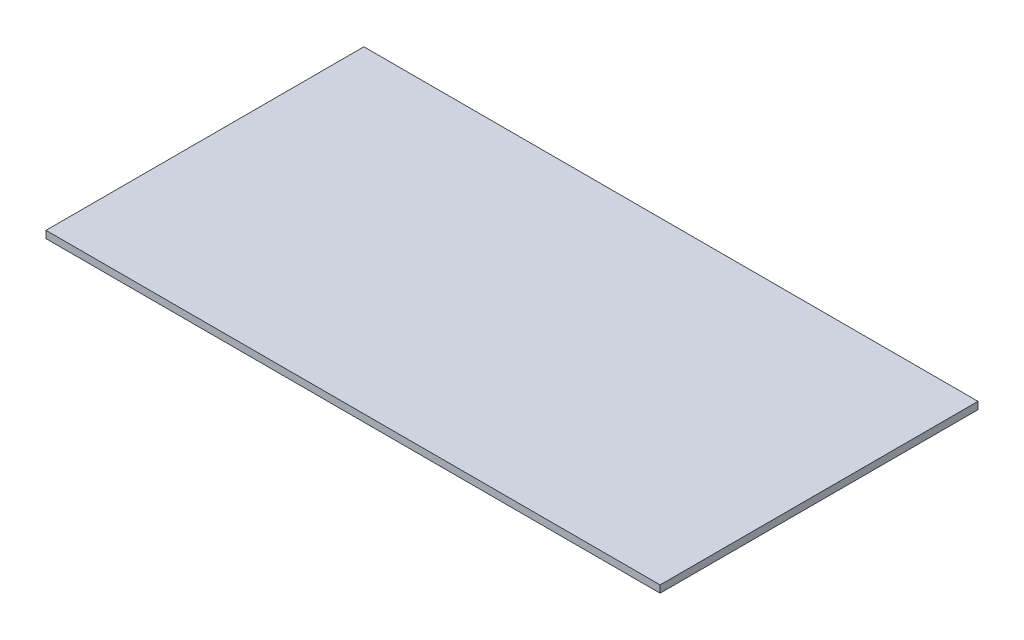
ISO-10303-21;
HEADER;
FILE_DESCRIPTION(('STEP AP214'),'2;1');
FILE_NAME('part.step','',(''),(''),'','','');
FILE_SCHEMA(('AUTOMOTIVE_DESIGN { 1 0 10303 214 1 1 1 1 }'));
ENDSEC;
DATA;
#1=APPLICATION_CONTEXT('core data for automotive mechanical design processes');
#2=APPLICATION_PROTOCOL_DEFINITION('international standard','automotive_design',2000,#1);
#3=PRODUCT_CONTEXT('',#1,'mechanical');
#4=PRODUCT('Part','Part','',(#3));
#5=PRODUCT_RELATED_PRODUCT_CATEGORY('part','',(#4));
#6=PRODUCT_DEFINITION_FORMATION('','',#4);
#7=PRODUCT_DEFINITION_CONTEXT('part definition',#1,'design');
#8=PRODUCT_DEFINITION('design','',#6,#7);
#9=PRODUCT_DEFINITION_SHAPE('','',#8);
#10=(LENGTH_UNIT() NAMED_UNIT(*) SI_UNIT(.MILLI.,.METRE.));
#11=(NAMED_UNIT(*) PLANE_ANGLE_UNIT() SI_UNIT($,.RADIAN.));
#12=(NAMED_UNIT(*) SI_UNIT($,.STERADIAN.) SOLID_ANGLE_UNIT());
#13=UNCERTAINTY_MEASURE_WITH_UNIT(LENGTH_MEASURE(1.E-05),#10,'distance_accuracy_value','');
#14=(GEOMETRIC_REPRESENTATION_CONTEXT(3) GLOBAL_UNCERTAINTY_ASSIGNED_CONTEXT((#13)) GLOBAL_UNIT_ASSIGNED_CONTEXT((#10,
#11,#12)) REPRESENTATION_CONTEXT('',''));
#15=CARTESIAN_POINT('',(0.,0.,0.));
#16=DIRECTION('',(0.,0.,1.));
#17=DIRECTION('',(1.,0.,0.));
#18=AXIS2_PLACEMENT_3D('',#15,#16,#17);
#19=CARTESIAN_POINT('',(-43.5537190082645,1.,-5.43388429752066));
#20=DIRECTION('',(1.,0.,0.));
#21=DIRECTION('',(0.,0.,-1.));
#22=AXIS2_PLACEMENT_3D('',#19,#20,#21);
#23=PLANE('',#22);
#24=DIRECTION('',(0.,0.,1.));
#25=VECTOR('',#24,1.);
#26=CARTESIAN_POINT('',(-43.5537190082645,0.,-5.43388429752066));
#27=LINE('',#26,#25);
#28=CARTESIAN_POINT('',(-43.5537190082645,0.,-5.43388429752066));
#29=VERTEX_POINT('',#28);
#30=CARTESIAN_POINT('',(-43.5537190082645,0.,38.5661157024793));
#31=VERTEX_POINT('',#30);
#32=EDGE_CURVE('E111',#29,#31,#27,.T.);
#33=ORIENTED_EDGE('',*,*,#32,.T.);
#34=DIRECTION('',(0.,-1.,0.));
#35=VECTOR('',#34,1.);
#36=CARTESIAN_POINT('',(-43.5537190082645,1.,38.5661157024793));
#37=LINE('',#36,#35);
#38=CARTESIAN_POINT('',(-43.5537190082645,1.,38.5661157024793));
#39=VERTEX_POINT('',#38);
#40=EDGE_CURVE('E11',#39,#31,#37,.T.);
#41=ORIENTED_EDGE('',*,*,#40,.F.);
#42=DIRECTION('',(0.,0.,1.));
#43=VECTOR('',#42,1.);
#44=CARTESIAN_POINT('',(-43.5537190082645,1.,-5.43388429752066));
#45=LINE('',#44,#43);
#46=CARTESIAN_POINT('',(-43.5537190082645,1.,-5.43388429752066));
#47=VERTEX_POINT('',#46);
#48=EDGE_CURVE('E95',#47,#39,#45,.T.);
#49=ORIENTED_EDGE('',*,*,#48,.F.);
#50=DIRECTION('',(0.,-1.,0.));
#51=VECTOR('',#50,1.);
#52=CARTESIAN_POINT('',(-43.5537190082645,1.,-5.43388429752066));
#53=LINE('',#52,#51);
#54=EDGE_CURVE('E107',#47,#29,#53,.T.);
#55=ORIENTED_EDGE('',*,*,#54,.T.);
#56=EDGE_LOOP('',(#33,#41,#49,#55));
#57=FACE_BOUND('',#56,.T.);
#58=ADVANCED_FACE('F43',(#57),#23,.F.);
#59=CARTESIAN_POINT('',(-43.5537190082645,1.,38.5661157024793));
#60=DIRECTION('',(0.,0.,-1.));
#61=DIRECTION('',(-1.,0.,0.));
#62=AXIS2_PLACEMENT_3D('',#59,#60,#61);
#63=PLANE('',#62);
#64=DIRECTION('',(1.,0.,0.));
#65=VECTOR('',#64,1.);
#66=CARTESIAN_POINT('',(-43.5537190082645,0.,38.5661157024793));
#67=LINE('',#66,#65);
#68=CARTESIAN_POINT('',(41.4462809917355,0.,38.5661157024793));
#69=VERTEX_POINT('',#68);
#70=EDGE_CURVE('E100',#31,#69,#67,.T.);
#71=ORIENTED_EDGE('',*,*,#70,.T.);
#72=DIRECTION('',(0.,-1.,0.));
#73=VECTOR('',#72,1.);
#74=CARTESIAN_POINT('',(41.4462809917355,1.,38.5661157024793));
#75=LINE('',#74,#73);
#76=CARTESIAN_POINT('',(41.4462809917355,1.,38.5661157024793));
#77=VERTEX_POINT('',#76);
#78=EDGE_CURVE('E52',#77,#69,#75,.T.);
#79=ORIENTED_EDGE('',*,*,#78,.F.);
#80=DIRECTION('',(1.,0.,0.));
#81=VECTOR('',#80,1.);
#82=CARTESIAN_POINT('',(-43.5537190082645,1.,38.5661157024793));
#83=LINE('',#82,#81);
#84=EDGE_CURVE('E90',#39,#77,#83,.T.);
#85=ORIENTED_EDGE('',*,*,#84,.F.);
#86=ORIENTED_EDGE('',*,*,#40,.T.);
#87=EDGE_LOOP('',(#71,#79,#85,#86));
#88=FACE_BOUND('',#87,.T.);
#89=ADVANCED_FACE('F99',(#88),#63,.F.);
#90=CARTESIAN_POINT('',(41.4462809917355,1.,-5.43388429752066));
#91=DIRECTION('',(-1.,0.,0.));
#92=DIRECTION('',(0.,0.,1.));
#93=AXIS2_PLACEMENT_3D('',#90,#91,#92);
#94=PLANE('',#93);
#95=DIRECTION('',(0.,0.,-1.));
#96=VECTOR('',#95,1.);
#97=CARTESIAN_POINT('',(41.4462809917355,0.,-5.43388429752066));
#98=LINE('',#97,#96);
#99=CARTESIAN_POINT('',(41.4462809917355,0.,-5.43388429752066));
#100=VERTEX_POINT('',#99);
#101=EDGE_CURVE('E77',#69,#100,#98,.T.);
#102=ORIENTED_EDGE('',*,*,#101,.T.);
#103=DIRECTION('',(0.,-1.,0.));
#104=VECTOR('',#103,1.);
#105=CARTESIAN_POINT('',(41.4462809917355,1.,-5.43388429752066));
#106=LINE('',#105,#104);
#107=CARTESIAN_POINT('',(41.4462809917355,1.,-5.43388429752066));
#108=VERTEX_POINT('',#107);
#109=EDGE_CURVE('E102',#108,#100,#106,.T.);
#110=ORIENTED_EDGE('',*,*,#109,.F.);
#111=DIRECTION('',(0.,0.,-1.));
#112=VECTOR('',#111,1.);
#113=CARTESIAN_POINT('',(41.4462809917355,1.,-5.43388429752066));
#114=LINE('',#113,#112);
#115=EDGE_CURVE('E93',#77,#108,#114,.T.);
#116=ORIENTED_EDGE('',*,*,#115,.F.);
#117=ORIENTED_EDGE('',*,*,#78,.T.);
#118=EDGE_LOOP('',(#102,#110,#116,#117));
#119=FACE_BOUND('',#118,.T.);
#120=ADVANCED_FACE('F103',(#119),#94,.F.);
#121=CARTESIAN_POINT('',(-43.5537190082645,1.,-5.43388429752066));
#122=DIRECTION('',(0.,0.,1.));
#123=DIRECTION('',(1.,0.,0.));
#124=AXIS2_PLACEMENT_3D('',#121,#122,#123);
#125=PLANE('',#124);
#126=DIRECTION('',(-1.,0.,0.));
#127=VECTOR('',#126,1.);
#128=CARTESIAN_POINT('',(-43.5537190082645,0.,-5.43388429752066));
#129=LINE('',#128,#127);
#130=EDGE_CURVE('E83',#100,#29,#129,.T.);
#131=ORIENTED_EDGE('',*,*,#130,.T.);
#132=ORIENTED_EDGE('',*,*,#54,.F.);
#133=DIRECTION('',(-1.,0.,0.));
#134=VECTOR('',#133,1.);
#135=CARTESIAN_POINT('',(-43.5537190082645,1.,-5.43388429752066));
#136=LINE('',#135,#134);
#137=EDGE_CURVE('E60',#108,#47,#136,.T.);
#138=ORIENTED_EDGE('',*,*,#137,.F.);
#139=ORIENTED_EDGE('',*,*,#109,.T.);
#140=EDGE_LOOP('',(#131,#132,#138,#139));
#141=FACE_BOUND('',#140,.T.);
#142=ADVANCED_FACE('F124',(#141),#125,.F.);
#143=CARTESIAN_POINT('',(0.,1.,0.));
#144=DIRECTION('',(0.,1.,0.));
#145=DIRECTION('',(0.,0.,1.));
#146=AXIS2_PLACEMENT_3D('',#143,#144,#145);
#147=PLANE('',#146);
#148=ORIENTED_EDGE('',*,*,#48,.T.);
#149=ORIENTED_EDGE('',*,*,#84,.T.);
#150=ORIENTED_EDGE('',*,*,#115,.T.);
#151=ORIENTED_EDGE('',*,*,#137,.T.);
#152=EDGE_LOOP('',(#148,#149,#150,#151));
#153=FACE_BOUND('',#152,.T.);
#154=ADVANCED_FACE('F91',(#153),#147,.T.);
#155=CARTESIAN_POINT('',(0.,0.,0.));
#156=DIRECTION('',(0.,1.,0.));
#157=DIRECTION('',(0.,0.,1.));
#158=AXIS2_PLACEMENT_3D('',#155,#156,#157);
#159=PLANE('',#158);
#160=ORIENTED_EDGE('',*,*,#32,.F.);
#161=ORIENTED_EDGE('',*,*,#130,.F.);
#162=ORIENTED_EDGE('',*,*,#101,.F.);
#163=ORIENTED_EDGE('',*,*,#70,.F.);
#164=EDGE_LOOP('',(#160,#161,#162,#163));
#165=FACE_BOUND('',#164,.T.);
#166=ADVANCED_FACE('F127',(#165),#159,.F.);
#167=CLOSED_SHELL('',(#58,#89,#120,#142,#154,#166));
#168=MANIFOLD_SOLID_BREP('B2',#167);
#169=ADVANCED_BREP_SHAPE_REPRESENTATION('',(#18,#168),#14);
#170=SHAPE_DEFINITION_REPRESENTATION(#9,#169);
ENDSEC;
END-ISO-10303-21;
